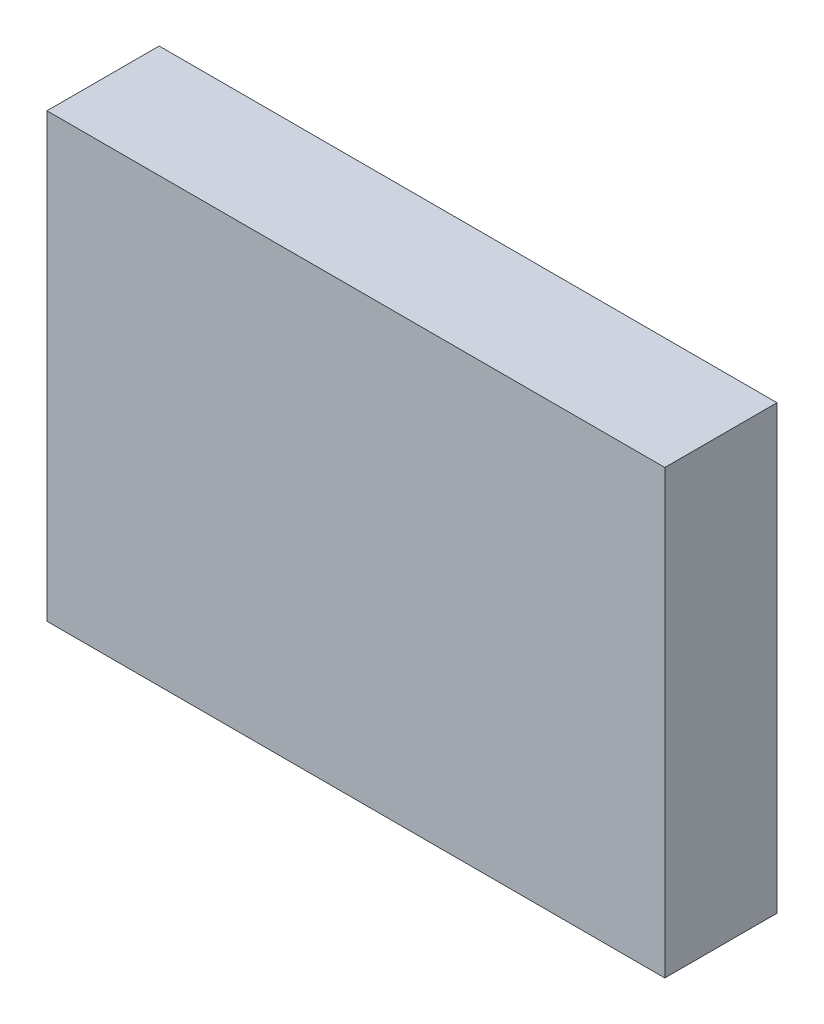
ISO-10303-21;
HEADER;
FILE_DESCRIPTION(('STEP AP214'),'2;1');
FILE_NAME('part.step','',(''),(''),'','','');
FILE_SCHEMA(('AUTOMOTIVE_DESIGN { 1 0 10303 214 1 1 1 1 }'));
ENDSEC;
DATA;
#1=APPLICATION_CONTEXT('core data for automotive mechanical design processes');
#2=APPLICATION_PROTOCOL_DEFINITION('international standard','automotive_design',2000,#1);
#3=PRODUCT_CONTEXT('',#1,'mechanical');
#4=PRODUCT('Part','Part','',(#3));
#5=PRODUCT_RELATED_PRODUCT_CATEGORY('part','',(#4));
#6=PRODUCT_DEFINITION_FORMATION('','',#4);
#7=PRODUCT_DEFINITION_CONTEXT('part definition',#1,'design');
#8=PRODUCT_DEFINITION('design','',#6,#7);
#9=PRODUCT_DEFINITION_SHAPE('','',#8);
#10=(LENGTH_UNIT() NAMED_UNIT(*) SI_UNIT(.MILLI.,.METRE.));
#11=(NAMED_UNIT(*) PLANE_ANGLE_UNIT() SI_UNIT($,.RADIAN.));
#12=(NAMED_UNIT(*) SI_UNIT($,.STERADIAN.) SOLID_ANGLE_UNIT());
#13=UNCERTAINTY_MEASURE_WITH_UNIT(LENGTH_MEASURE(1.E-05),#10,'distance_accuracy_value','');
#14=(GEOMETRIC_REPRESENTATION_CONTEXT(3) GLOBAL_UNCERTAINTY_ASSIGNED_CONTEXT((#13)) GLOBAL_UNIT_ASSIGNED_CONTEXT((#10,
#11,#12)) REPRESENTATION_CONTEXT('',''));
#15=CARTESIAN_POINT('',(0.,0.,0.));
#16=DIRECTION('',(0.,0.,1.));
#17=DIRECTION('',(1.,0.,0.));
#18=AXIS2_PLACEMENT_3D('',#15,#16,#17);
#19=CARTESIAN_POINT('',(0.222348251639588,-0.151693390465288,0.));
#20=DIRECTION('',(0.,1.,0.));
#21=DIRECTION('',(-1.,0.,0.));
#22=AXIS2_PLACEMENT_3D('',#19,#20,#21);
#23=PLANE('',#22);
#24=DIRECTION('',(-1.,0.,0.));
#25=VECTOR('',#24,1.);
#26=CARTESIAN_POINT('',(0.222348251639588,-0.151693390465288,0.));
#27=LINE('',#26,#25);
#28=CARTESIAN_POINT('',(0.222348251639588,-0.151693390465288,0.));
#29=VERTEX_POINT('',#28);
#30=CARTESIAN_POINT('',(0.205824988466813,-0.151693390465288,0.));
#31=VERTEX_POINT('',#30);
#32=EDGE_CURVE('E11',#29,#31,#27,.T.);
#33=ORIENTED_EDGE('',*,*,#32,.T.);
#34=DIRECTION('',(0.,0.,1.));
#35=VECTOR('',#34,1.);
#36=CARTESIAN_POINT('',(0.205824988466813,-0.151693390465288,0.));
#37=LINE('',#36,#35);
#38=CARTESIAN_POINT('',(0.205824988466813,-0.151693390465288,0.003));
#39=VERTEX_POINT('',#38);
#40=EDGE_CURVE('E24',#31,#39,#37,.T.);
#41=ORIENTED_EDGE('',*,*,#40,.T.);
#42=DIRECTION('',(-1.,0.,0.));
#43=VECTOR('',#42,1.);
#44=CARTESIAN_POINT('',(0.222348251639588,-0.151693390465288,0.003));
#45=LINE('',#44,#43);
#46=CARTESIAN_POINT('',(0.222348251639588,-0.151693390465288,0.003));
#47=VERTEX_POINT('',#46);
#48=EDGE_CURVE('E75',#47,#39,#45,.T.);
#49=ORIENTED_EDGE('',*,*,#48,.F.);
#50=DIRECTION('',(0.,0.,1.));
#51=VECTOR('',#50,1.);
#52=CARTESIAN_POINT('',(0.222348251639588,-0.151693390465288,0.));
#53=LINE('',#52,#51);
#54=EDGE_CURVE('E86',#29,#47,#53,.T.);
#55=ORIENTED_EDGE('',*,*,#54,.F.);
#56=EDGE_LOOP('',(#33,#41,#49,#55));
#57=FACE_BOUND('',#56,.T.);
#58=ADVANCED_FACE('F17',(#57),#23,.T.);
#59=CARTESIAN_POINT('',(0.222348251639588,-0.16351688575348,0.));
#60=DIRECTION('',(1.,0.,0.));
#61=DIRECTION('',(0.,1.,0.));
#62=AXIS2_PLACEMENT_3D('',#59,#60,#61);
#63=PLANE('',#62);
#64=DIRECTION('',(0.,1.,0.));
#65=VECTOR('',#64,1.);
#66=CARTESIAN_POINT('',(0.222348251639588,-0.16351688575348,0.));
#67=LINE('',#66,#65);
#68=CARTESIAN_POINT('',(0.222348251639588,-0.16351688575348,0.));
#69=VERTEX_POINT('',#68);
#70=EDGE_CURVE('E83',#69,#29,#67,.T.);
#71=ORIENTED_EDGE('',*,*,#70,.T.);
#72=ORIENTED_EDGE('',*,*,#54,.T.);
#73=DIRECTION('',(0.,1.,0.));
#74=VECTOR('',#73,1.);
#75=CARTESIAN_POINT('',(0.222348251639588,-0.16351688575348,0.003));
#76=LINE('',#75,#74);
#77=CARTESIAN_POINT('',(0.222348251639588,-0.16351688575348,0.003));
#78=VERTEX_POINT('',#77);
#79=EDGE_CURVE('E81',#78,#47,#76,.T.);
#80=ORIENTED_EDGE('',*,*,#79,.F.);
#81=DIRECTION('',(0.,0.,1.));
#82=VECTOR('',#81,1.);
#83=CARTESIAN_POINT('',(0.222348251639588,-0.16351688575348,0.));
#84=LINE('',#83,#82);
#85=EDGE_CURVE('E61',#69,#78,#84,.T.);
#86=ORIENTED_EDGE('',*,*,#85,.F.);
#87=EDGE_LOOP('',(#71,#72,#80,#86));
#88=FACE_BOUND('',#87,.T.);
#89=ADVANCED_FACE('F91',(#88),#63,.T.);
#90=CARTESIAN_POINT('',(0.205824988466813,-0.16351688575348,0.));
#91=DIRECTION('',(0.,-1.,0.));
#92=DIRECTION('',(1.,0.,0.));
#93=AXIS2_PLACEMENT_3D('',#90,#91,#92);
#94=PLANE('',#93);
#95=DIRECTION('',(1.,0.,0.));
#96=VECTOR('',#95,1.);
#97=CARTESIAN_POINT('',(0.205824988466813,-0.16351688575348,0.));
#98=LINE('',#97,#96);
#99=CARTESIAN_POINT('',(0.205824988466813,-0.16351688575348,0.));
#100=VERTEX_POINT('',#99);
#101=EDGE_CURVE('E65',#100,#69,#98,.T.);
#102=ORIENTED_EDGE('',*,*,#101,.T.);
#103=ORIENTED_EDGE('',*,*,#85,.T.);
#104=DIRECTION('',(1.,0.,0.));
#105=VECTOR('',#104,1.);
#106=CARTESIAN_POINT('',(0.205824988466813,-0.16351688575348,0.003));
#107=LINE('',#106,#105);
#108=CARTESIAN_POINT('',(0.205824988466813,-0.16351688575348,0.003));
#109=VERTEX_POINT('',#108);
#110=EDGE_CURVE('E54',#109,#78,#107,.T.);
#111=ORIENTED_EDGE('',*,*,#110,.F.);
#112=DIRECTION('',(0.,0.,1.));
#113=VECTOR('',#112,1.);
#114=CARTESIAN_POINT('',(0.205824988466813,-0.16351688575348,0.));
#115=LINE('',#114,#113);
#116=EDGE_CURVE('E58',#100,#109,#115,.T.);
#117=ORIENTED_EDGE('',*,*,#116,.F.);
#118=EDGE_LOOP('',(#102,#103,#111,#117));
#119=FACE_BOUND('',#118,.T.);
#120=ADVANCED_FACE('F57',(#119),#94,.T.);
#121=CARTESIAN_POINT('',(0.205824988466813,-0.151693390465288,0.));
#122=DIRECTION('',(-1.,0.,0.));
#123=DIRECTION('',(0.,-1.,0.));
#124=AXIS2_PLACEMENT_3D('',#121,#122,#123);
#125=PLANE('',#124);
#126=DIRECTION('',(0.,-1.,0.));
#127=VECTOR('',#126,1.);
#128=CARTESIAN_POINT('',(0.205824988466813,-0.151693390465288,0.));
#129=LINE('',#128,#127);
#130=EDGE_CURVE('E71',#31,#100,#129,.T.);
#131=ORIENTED_EDGE('',*,*,#130,.T.);
#132=ORIENTED_EDGE('',*,*,#116,.T.);
#133=DIRECTION('',(0.,-1.,0.));
#134=VECTOR('',#133,1.);
#135=CARTESIAN_POINT('',(0.205824988466813,-0.151693390465288,0.003));
#136=LINE('',#135,#134);
#137=EDGE_CURVE('E70',#39,#109,#136,.T.);
#138=ORIENTED_EDGE('',*,*,#137,.F.);
#139=ORIENTED_EDGE('',*,*,#40,.F.);
#140=EDGE_LOOP('',(#131,#132,#138,#139));
#141=FACE_BOUND('',#140,.T.);
#142=ADVANCED_FACE('F69',(#141),#125,.T.);
#143=CARTESIAN_POINT('',(0.2140866200532,-0.157605138109384,0.003));
#144=DIRECTION('',(0.,0.,1.));
#145=DIRECTION('',(1.,0.,0.));
#146=AXIS2_PLACEMENT_3D('',#143,#144,#145);
#147=PLANE('',#146);
#148=ORIENTED_EDGE('',*,*,#137,.T.);
#149=ORIENTED_EDGE('',*,*,#110,.T.);
#150=ORIENTED_EDGE('',*,*,#79,.T.);
#151=ORIENTED_EDGE('',*,*,#48,.T.);
#152=EDGE_LOOP('',(#148,#149,#150,#151));
#153=FACE_BOUND('',#152,.T.);
#154=ADVANCED_FACE('F74',(#153),#147,.T.);
#155=CARTESIAN_POINT('',(0.2140866200532,-0.157605138109384,0.));
#156=DIRECTION('',(0.,0.,1.));
#157=DIRECTION('',(1.,0.,0.));
#158=AXIS2_PLACEMENT_3D('',#155,#156,#157);
#159=PLANE('',#158);
#160=ORIENTED_EDGE('',*,*,#130,.F.);
#161=ORIENTED_EDGE('',*,*,#32,.F.);
#162=ORIENTED_EDGE('',*,*,#70,.F.);
#163=ORIENTED_EDGE('',*,*,#101,.F.);
#164=EDGE_LOOP('',(#160,#161,#162,#163));
#165=FACE_BOUND('',#164,.T.);
#166=ADVANCED_FACE('F89',(#165),#159,.F.);
#167=CLOSED_SHELL('',(#58,#89,#120,#142,#154,#166));
#168=MANIFOLD_SOLID_BREP('B1',#167);
#169=ADVANCED_BREP_SHAPE_REPRESENTATION('',(#18,#168),#14);
#170=SHAPE_DEFINITION_REPRESENTATION(#9,#169);
ENDSEC;
END-ISO-10303-21;
